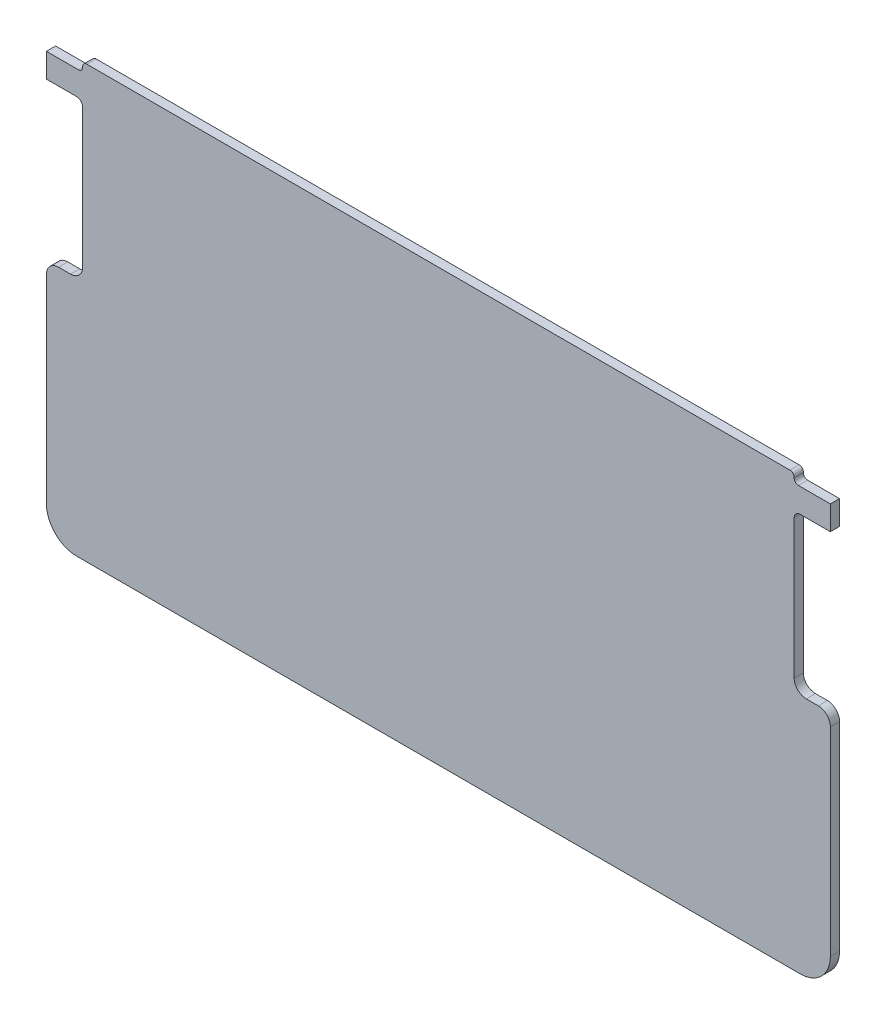
ISO-10303-21;
HEADER;
FILE_DESCRIPTION(('STEP AP214'),'2;1');
FILE_NAME('part.step','',(''),(''),'','','');
FILE_SCHEMA(('AUTOMOTIVE_DESIGN { 1 0 10303 214 1 1 1 1 }'));
ENDSEC;
DATA;
#1=APPLICATION_CONTEXT('core data for automotive mechanical design processes');
#2=APPLICATION_PROTOCOL_DEFINITION('international standard','automotive_design',2000,#1);
#3=PRODUCT_CONTEXT('',#1,'mechanical');
#4=PRODUCT('Part','Part','',(#3));
#5=PRODUCT_RELATED_PRODUCT_CATEGORY('part','',(#4));
#6=PRODUCT_DEFINITION_FORMATION('','',#4);
#7=PRODUCT_DEFINITION_CONTEXT('part definition',#1,'design');
#8=PRODUCT_DEFINITION('design','',#6,#7);
#9=PRODUCT_DEFINITION_SHAPE('','',#8);
#10=(LENGTH_UNIT() NAMED_UNIT(*) SI_UNIT(.MILLI.,.METRE.));
#11=(NAMED_UNIT(*) PLANE_ANGLE_UNIT() SI_UNIT($,.RADIAN.));
#12=(NAMED_UNIT(*) SI_UNIT($,.STERADIAN.) SOLID_ANGLE_UNIT());
#13=UNCERTAINTY_MEASURE_WITH_UNIT(LENGTH_MEASURE(1.E-05),#10,'distance_accuracy_value','');
#14=(GEOMETRIC_REPRESENTATION_CONTEXT(3) GLOBAL_UNCERTAINTY_ASSIGNED_CONTEXT((#13)) GLOBAL_UNIT_ASSIGNED_CONTEXT((#10,
#11,#12)) REPRESENTATION_CONTEXT('',''));
#15=CARTESIAN_POINT('',(0.,0.,0.));
#16=DIRECTION('',(0.,0.,1.));
#17=DIRECTION('',(1.,0.,0.));
#18=AXIS2_PLACEMENT_3D('',#15,#16,#17);
#19=CARTESIAN_POINT('',(-29.5,-34.,-0.381));
#20=DIRECTION('',(0.,-1.,0.));
#21=DIRECTION('',(0.,0.,-1.));
#22=AXIS2_PLACEMENT_3D('',#19,#20,#21);
#23=PLANE('',#22);
#24=DIRECTION('',(0.,0.,1.));
#25=VECTOR('',#24,1.);
#26=CARTESIAN_POINT('',(30.,-34.,-0.381));
#27=LINE('',#26,#25);
#28=CARTESIAN_POINT('',(30.,-34.,-0.381));
#29=VERTEX_POINT('',#28);
#30=CARTESIAN_POINT('',(30.,-34.,0.381));
#31=VERTEX_POINT('',#30);
#32=EDGE_CURVE('E38',#29,#31,#27,.T.);
#33=ORIENTED_EDGE('',*,*,#32,.T.);
#34=DIRECTION('',(1.,0.,0.));
#35=VECTOR('',#34,1.);
#36=CARTESIAN_POINT('',(29.5,-34.,0.381));
#37=LINE('',#36,#35);
#38=CARTESIAN_POINT('',(-30.,-34.,0.381));
#39=VERTEX_POINT('',#38);
#40=EDGE_CURVE('E222',#39,#31,#37,.T.);
#41=ORIENTED_EDGE('',*,*,#40,.F.);
#42=DIRECTION('',(0.,0.,1.));
#43=VECTOR('',#42,1.);
#44=CARTESIAN_POINT('',(-30.,-34.,-0.381));
#45=LINE('',#44,#43);
#46=CARTESIAN_POINT('',(-30.,-34.,-0.381));
#47=VERTEX_POINT('',#46);
#48=EDGE_CURVE('E11',#47,#39,#45,.T.);
#49=ORIENTED_EDGE('',*,*,#48,.F.);
#50=DIRECTION('',(1.,0.,0.));
#51=VECTOR('',#50,1.);
#52=CARTESIAN_POINT('',(29.5,-34.,-0.381));
#53=LINE('',#52,#51);
#54=EDGE_CURVE('E51',#47,#29,#53,.T.);
#55=ORIENTED_EDGE('',*,*,#54,.T.);
#56=EDGE_LOOP('',(#33,#41,#49,#55));
#57=FACE_BOUND('',#56,.T.);
#58=ADVANCED_FACE('F34',(#57),#23,.T.);
#59=CARTESIAN_POINT('',(-30.,-31.5,-0.381));
#60=DIRECTION('',(0.,0.,1.));
#61=DIRECTION('',(1.,0.,0.));
#62=AXIS2_PLACEMENT_3D('',#59,#60,#61);
#63=CYLINDRICAL_SURFACE('',#62,2.5);
#64=ORIENTED_EDGE('',*,*,#48,.T.);
#65=CARTESIAN_POINT('',(-30.,-31.5,0.381));
#66=DIRECTION('',(0.,0.,1.));
#67=DIRECTION('',(-1.,0.,0.));
#68=AXIS2_PLACEMENT_3D('',#65,#66,#67);
#69=CIRCLE('',#68,2.5);
#70=CARTESIAN_POINT('',(-32.5,-31.5,0.381));
#71=VERTEX_POINT('',#70);
#72=EDGE_CURVE('E237',#71,#39,#69,.T.);
#73=ORIENTED_EDGE('',*,*,#72,.F.);
#74=DIRECTION('',(0.,0.,1.));
#75=VECTOR('',#74,1.);
#76=CARTESIAN_POINT('',(-32.5,-31.5,-0.381));
#77=LINE('',#76,#75);
#78=CARTESIAN_POINT('',(-32.5,-31.5,-0.381));
#79=VERTEX_POINT('',#78);
#80=EDGE_CURVE('E43',#79,#71,#77,.T.);
#81=ORIENTED_EDGE('',*,*,#80,.F.);
#82=CARTESIAN_POINT('',(-30.,-31.5,-0.381));
#83=DIRECTION('',(0.,0.,1.));
#84=DIRECTION('',(-1.,0.,0.));
#85=AXIS2_PLACEMENT_3D('',#82,#83,#84);
#86=CIRCLE('',#85,2.5);
#87=EDGE_CURVE('E227',#79,#47,#86,.T.);
#88=ORIENTED_EDGE('',*,*,#87,.T.);
#89=EDGE_LOOP('',(#64,#73,#81,#88));
#90=FACE_BOUND('',#89,.T.);
#91=ADVANCED_FACE('F540',(#90),#63,.T.);
#92=CARTESIAN_POINT('',(-32.5,-15.,-0.381));
#93=DIRECTION('',(-1.,0.,0.));
#94=DIRECTION('',(0.,-1.,0.));
#95=AXIS2_PLACEMENT_3D('',#92,#93,#94);
#96=PLANE('',#95);
#97=ORIENTED_EDGE('',*,*,#80,.T.);
#98=DIRECTION('',(0.,-1.,0.));
#99=VECTOR('',#98,1.);
#100=CARTESIAN_POINT('',(-32.5,-15.,0.381));
#101=LINE('',#100,#99);
#102=CARTESIAN_POINT('',(-32.5,-15.,0.381));
#103=VERTEX_POINT('',#102);
#104=EDGE_CURVE('E310',#103,#71,#101,.T.);
#105=ORIENTED_EDGE('',*,*,#104,.F.);
#106=DIRECTION('',(0.,0.,1.));
#107=VECTOR('',#106,1.);
#108=CARTESIAN_POINT('',(-32.5,-15.,-0.381));
#109=LINE('',#108,#107);
#110=CARTESIAN_POINT('',(-32.5,-15.,-0.381));
#111=VERTEX_POINT('',#110);
#112=EDGE_CURVE('E393',#111,#103,#109,.T.);
#113=ORIENTED_EDGE('',*,*,#112,.F.);
#114=DIRECTION('',(0.,-1.,0.));
#115=VECTOR('',#114,1.);
#116=CARTESIAN_POINT('',(-32.5,-15.,-0.381));
#117=LINE('',#116,#115);
#118=EDGE_CURVE('E388',#111,#79,#117,.T.);
#119=ORIENTED_EDGE('',*,*,#118,.T.);
#120=EDGE_LOOP('',(#97,#105,#113,#119));
#121=FACE_BOUND('',#120,.T.);
#122=ADVANCED_FACE('F538',(#121),#96,.T.);
#123=CARTESIAN_POINT('',(-31.5,-15.,-0.381));
#124=DIRECTION('',(0.,0.,1.));
#125=DIRECTION('',(1.,0.,0.));
#126=AXIS2_PLACEMENT_3D('',#123,#124,#125);
#127=CYLINDRICAL_SURFACE('',#126,1.);
#128=ORIENTED_EDGE('',*,*,#112,.T.);
#129=CARTESIAN_POINT('',(-31.5,-15.,0.381));
#130=DIRECTION('',(0.,0.,1.));
#131=DIRECTION('',(1.,0.,0.));
#132=AXIS2_PLACEMENT_3D('',#129,#130,#131);
#133=CIRCLE('',#132,1.);
#134=CARTESIAN_POINT('',(-31.5,-14.,0.381));
#135=VERTEX_POINT('',#134);
#136=EDGE_CURVE('E307',#135,#103,#133,.T.);
#137=ORIENTED_EDGE('',*,*,#136,.F.);
#138=DIRECTION('',(0.,0.,1.));
#139=VECTOR('',#138,1.);
#140=CARTESIAN_POINT('',(-31.5,-14.,-0.381));
#141=LINE('',#140,#139);
#142=CARTESIAN_POINT('',(-31.5,-14.,-0.381));
#143=VERTEX_POINT('',#142);
#144=EDGE_CURVE('E395',#143,#135,#141,.T.);
#145=ORIENTED_EDGE('',*,*,#144,.F.);
#146=CARTESIAN_POINT('',(-31.5,-15.,-0.381));
#147=DIRECTION('',(0.,0.,1.));
#148=DIRECTION('',(1.,0.,0.));
#149=AXIS2_PLACEMENT_3D('',#146,#147,#148);
#150=CIRCLE('',#149,1.);
#151=EDGE_CURVE('E385',#143,#111,#150,.T.);
#152=ORIENTED_EDGE('',*,*,#151,.T.);
#153=EDGE_LOOP('',(#128,#137,#145,#152));
#154=FACE_BOUND('',#153,.T.);
#155=ADVANCED_FACE('F535',(#154),#127,.T.);
#156=CARTESIAN_POINT('',(-30.5,-14.,-0.381));
#157=DIRECTION('',(0.,1.,0.));
#158=DIRECTION('',(-1.,0.,0.));
#159=AXIS2_PLACEMENT_3D('',#156,#157,#158);
#160=PLANE('',#159);
#161=ORIENTED_EDGE('',*,*,#144,.T.);
#162=DIRECTION('',(-1.,0.,0.));
#163=VECTOR('',#162,1.);
#164=CARTESIAN_POINT('',(-30.5,-14.,0.381));
#165=LINE('',#164,#163);
#166=CARTESIAN_POINT('',(-30.5,-14.,0.381));
#167=VERTEX_POINT('',#166);
#168=EDGE_CURVE('E304',#167,#135,#165,.T.);
#169=ORIENTED_EDGE('',*,*,#168,.F.);
#170=DIRECTION('',(0.,0.,1.));
#171=VECTOR('',#170,1.);
#172=CARTESIAN_POINT('',(-30.5,-14.,-0.381));
#173=LINE('',#172,#171);
#174=CARTESIAN_POINT('',(-30.5,-14.,-0.381));
#175=VERTEX_POINT('',#174);
#176=EDGE_CURVE('E397',#175,#167,#173,.T.);
#177=ORIENTED_EDGE('',*,*,#176,.F.);
#178=DIRECTION('',(-1.,0.,0.));
#179=VECTOR('',#178,1.);
#180=CARTESIAN_POINT('',(-30.5,-14.,-0.381));
#181=LINE('',#180,#179);
#182=EDGE_CURVE('E382',#175,#143,#181,.T.);
#183=ORIENTED_EDGE('',*,*,#182,.T.);
#184=EDGE_LOOP('',(#161,#169,#177,#183));
#185=FACE_BOUND('',#184,.T.);
#186=ADVANCED_FACE('F533',(#185),#160,.T.);
#187=CARTESIAN_POINT('',(-30.5,-13.,-0.381));
#188=DIRECTION('',(0.,0.,1.));
#189=DIRECTION('',(1.,0.,0.));
#190=AXIS2_PLACEMENT_3D('',#187,#188,#189);
#191=CYLINDRICAL_SURFACE('',#190,0.999999999999998);
#192=ORIENTED_EDGE('',*,*,#176,.T.);
#193=CARTESIAN_POINT('',(-30.5,-13.,0.381));
#194=DIRECTION('',(0.,0.,-1.));
#195=DIRECTION('',(-1.,0.,0.));
#196=AXIS2_PLACEMENT_3D('',#193,#194,#195);
#197=CIRCLE('',#196,0.999999999999998);
#198=CARTESIAN_POINT('',(-29.5,-13.,0.381));
#199=VERTEX_POINT('',#198);
#200=EDGE_CURVE('E301',#199,#167,#197,.T.);
#201=ORIENTED_EDGE('',*,*,#200,.F.);
#202=DIRECTION('',(0.,0.,1.));
#203=VECTOR('',#202,1.);
#204=CARTESIAN_POINT('',(-29.5,-13.,-0.381));
#205=LINE('',#204,#203);
#206=CARTESIAN_POINT('',(-29.5,-13.,-0.381));
#207=VERTEX_POINT('',#206);
#208=EDGE_CURVE('E399',#207,#199,#205,.T.);
#209=ORIENTED_EDGE('',*,*,#208,.F.);
#210=CARTESIAN_POINT('',(-30.5,-13.,-0.381));
#211=DIRECTION('',(0.,0.,-1.));
#212=DIRECTION('',(-1.,0.,0.));
#213=AXIS2_PLACEMENT_3D('',#210,#211,#212);
#214=CIRCLE('',#213,0.999999999999998);
#215=EDGE_CURVE('E379',#207,#175,#214,.T.);
#216=ORIENTED_EDGE('',*,*,#215,.T.);
#217=EDGE_LOOP('',(#192,#201,#209,#216));
#218=FACE_BOUND('',#217,.T.);
#219=ADVANCED_FACE('F528',(#218),#191,.F.);
#220=CARTESIAN_POINT('',(-29.5,-1.5,-0.381));
#221=DIRECTION('',(-1.,0.,0.));
#222=DIRECTION('',(0.,-1.,0.));
#223=AXIS2_PLACEMENT_3D('',#220,#221,#222);
#224=PLANE('',#223);
#225=ORIENTED_EDGE('',*,*,#208,.T.);
#226=DIRECTION('',(0.,-1.,0.));
#227=VECTOR('',#226,1.);
#228=CARTESIAN_POINT('',(-29.5,-1.5,0.381));
#229=LINE('',#228,#227);
#230=CARTESIAN_POINT('',(-29.5,-1.5,0.381));
#231=VERTEX_POINT('',#230);
#232=EDGE_CURVE('E298',#231,#199,#229,.T.);
#233=ORIENTED_EDGE('',*,*,#232,.F.);
#234=DIRECTION('',(0.,0.,1.));
#235=VECTOR('',#234,1.);
#236=CARTESIAN_POINT('',(-29.5,-1.5,-0.381));
#237=LINE('',#236,#235);
#238=CARTESIAN_POINT('',(-29.5,-1.5,-0.381));
#239=VERTEX_POINT('',#238);
#240=EDGE_CURVE('E401',#239,#231,#237,.T.);
#241=ORIENTED_EDGE('',*,*,#240,.F.);
#242=DIRECTION('',(0.,-1.,0.));
#243=VECTOR('',#242,1.);
#244=CARTESIAN_POINT('',(-29.5,-1.5,-0.381));
#245=LINE('',#244,#243);
#246=EDGE_CURVE('E376',#239,#207,#245,.T.);
#247=ORIENTED_EDGE('',*,*,#246,.T.);
#248=EDGE_LOOP('',(#225,#233,#241,#247));
#249=FACE_BOUND('',#248,.T.);
#250=ADVANCED_FACE('F523',(#249),#224,.T.);
#251=CARTESIAN_POINT('',(-30.,-1.5,-0.381));
#252=DIRECTION('',(0.,0.,1.));
#253=DIRECTION('',(1.,0.,0.));
#254=AXIS2_PLACEMENT_3D('',#251,#252,#253);
#255=CYLINDRICAL_SURFACE('',#254,0.500000000000002);
#256=ORIENTED_EDGE('',*,*,#240,.T.);
#257=CARTESIAN_POINT('',(-30.,-1.5,0.381));
#258=DIRECTION('',(0.,0.,-1.));
#259=DIRECTION('',(1.,0.,0.));
#260=AXIS2_PLACEMENT_3D('',#257,#258,#259);
#261=CIRCLE('',#260,0.500000000000002);
#262=CARTESIAN_POINT('',(-30.,-1.,0.381));
#263=VERTEX_POINT('',#262);
#264=EDGE_CURVE('E295',#263,#231,#261,.T.);
#265=ORIENTED_EDGE('',*,*,#264,.F.);
#266=DIRECTION('',(0.,0.,1.));
#267=VECTOR('',#266,1.);
#268=CARTESIAN_POINT('',(-30.,-1.,-0.381));
#269=LINE('',#268,#267);
#270=CARTESIAN_POINT('',(-30.,-1.,-0.381));
#271=VERTEX_POINT('',#270);
#272=EDGE_CURVE('E403',#271,#263,#269,.T.);
#273=ORIENTED_EDGE('',*,*,#272,.F.);
#274=CARTESIAN_POINT('',(-30.,-1.5,-0.381));
#275=DIRECTION('',(0.,0.,-1.));
#276=DIRECTION('',(1.,0.,0.));
#277=AXIS2_PLACEMENT_3D('',#274,#275,#276);
#278=CIRCLE('',#277,0.500000000000002);
#279=EDGE_CURVE('E373',#271,#239,#278,.T.);
#280=ORIENTED_EDGE('',*,*,#279,.T.);
#281=EDGE_LOOP('',(#256,#265,#273,#280));
#282=FACE_BOUND('',#281,.T.);
#283=ADVANCED_FACE('F521',(#282),#255,.F.);
#284=CARTESIAN_POINT('',(-30.,-1.,-0.381));
#285=DIRECTION('',(0.,-1.,0.));
#286=DIRECTION('',(1.,0.,0.));
#287=AXIS2_PLACEMENT_3D('',#284,#285,#286);
#288=PLANE('',#287);
#289=ORIENTED_EDGE('',*,*,#272,.T.);
#290=DIRECTION('',(1.,0.,0.));
#291=VECTOR('',#290,1.);
#292=CARTESIAN_POINT('',(-30.,-1.,0.381));
#293=LINE('',#292,#291);
#294=CARTESIAN_POINT('',(-32.5,-0.999999999999996,0.381));
#295=VERTEX_POINT('',#294);
#296=EDGE_CURVE('E292',#295,#263,#293,.T.);
#297=ORIENTED_EDGE('',*,*,#296,.F.);
#298=DIRECTION('',(0.,0.,1.));
#299=VECTOR('',#298,1.);
#300=CARTESIAN_POINT('',(-32.5,-0.999999999999996,-0.381));
#301=LINE('',#300,#299);
#302=CARTESIAN_POINT('',(-32.5,-0.999999999999996,-0.381));
#303=VERTEX_POINT('',#302);
#304=EDGE_CURVE('E405',#303,#295,#301,.T.);
#305=ORIENTED_EDGE('',*,*,#304,.F.);
#306=DIRECTION('',(1.,0.,0.));
#307=VECTOR('',#306,1.);
#308=CARTESIAN_POINT('',(-30.,-1.,-0.381));
#309=LINE('',#308,#307);
#310=EDGE_CURVE('E370',#303,#271,#309,.T.);
#311=ORIENTED_EDGE('',*,*,#310,.T.);
#312=EDGE_LOOP('',(#289,#297,#305,#311));
#313=FACE_BOUND('',#312,.T.);
#314=ADVANCED_FACE('F516',(#313),#288,.T.);
#315=CARTESIAN_POINT('',(-32.5,-0.999999999999996,-0.381));
#316=DIRECTION('',(-1.,0.,0.));
#317=DIRECTION('',(0.,0.,1.));
#318=AXIS2_PLACEMENT_3D('',#315,#316,#317);
#319=PLANE('',#318);
#320=ORIENTED_EDGE('',*,*,#304,.T.);
#321=DIRECTION('',(0.,-1.,0.));
#322=VECTOR('',#321,1.);
#323=CARTESIAN_POINT('',(-32.5,-0.999999999999996,0.381));
#324=LINE('',#323,#322);
#325=CARTESIAN_POINT('',(-32.5,1.,0.381));
#326=VERTEX_POINT('',#325);
#327=EDGE_CURVE('E289',#326,#295,#324,.T.);
#328=ORIENTED_EDGE('',*,*,#327,.F.);
#329=DIRECTION('',(0.,0.,1.));
#330=VECTOR('',#329,1.);
#331=CARTESIAN_POINT('',(-32.5,1.,-0.381));
#332=LINE('',#331,#330);
#333=CARTESIAN_POINT('',(-32.5,1.,-0.381));
#334=VERTEX_POINT('',#333);
#335=EDGE_CURVE('E407',#334,#326,#332,.T.);
#336=ORIENTED_EDGE('',*,*,#335,.F.);
#337=DIRECTION('',(0.,-1.,0.));
#338=VECTOR('',#337,1.);
#339=CARTESIAN_POINT('',(-32.5,-0.999999999999996,-0.381));
#340=LINE('',#339,#338);
#341=EDGE_CURVE('E367',#334,#303,#340,.T.);
#342=ORIENTED_EDGE('',*,*,#341,.T.);
#343=EDGE_LOOP('',(#320,#328,#336,#342));
#344=FACE_BOUND('',#343,.T.);
#345=ADVANCED_FACE('F511',(#344),#319,.T.);
#346=CARTESIAN_POINT('',(-32.5,1.,-0.381));
#347=DIRECTION('',(0.,1.,0.));
#348=DIRECTION('',(0.,0.,1.));
#349=AXIS2_PLACEMENT_3D('',#346,#347,#348);
#350=PLANE('',#349);
#351=ORIENTED_EDGE('',*,*,#335,.T.);
#352=DIRECTION('',(-1.,0.,0.));
#353=VECTOR('',#352,1.);
#354=CARTESIAN_POINT('',(-32.5,1.,0.381));
#355=LINE('',#354,#353);
#356=CARTESIAN_POINT('',(-29.85,1.,0.381));
#357=VERTEX_POINT('',#356);
#358=EDGE_CURVE('E286',#357,#326,#355,.T.);
#359=ORIENTED_EDGE('',*,*,#358,.F.);
#360=DIRECTION('',(0.,0.,1.));
#361=VECTOR('',#360,1.);
#362=CARTESIAN_POINT('',(-29.85,1.,-0.381));
#363=LINE('',#362,#361);
#364=CARTESIAN_POINT('',(-29.85,1.,-0.381));
#365=VERTEX_POINT('',#364);
#366=EDGE_CURVE('E409',#365,#357,#363,.T.);
#367=ORIENTED_EDGE('',*,*,#366,.F.);
#368=DIRECTION('',(-1.,0.,0.));
#369=VECTOR('',#368,1.);
#370=CARTESIAN_POINT('',(-32.5,1.,-0.381));
#371=LINE('',#370,#369);
#372=EDGE_CURVE('E364',#365,#334,#371,.T.);
#373=ORIENTED_EDGE('',*,*,#372,.T.);
#374=EDGE_LOOP('',(#351,#359,#367,#373));
#375=FACE_BOUND('',#374,.T.);
#376=ADVANCED_FACE('F509',(#375),#350,.T.);
#377=CARTESIAN_POINT('',(-29.85,1.35,-0.381));
#378=DIRECTION('',(0.,0.,1.));
#379=DIRECTION('',(1.,0.,0.));
#380=AXIS2_PLACEMENT_3D('',#377,#378,#379);
#381=CYLINDRICAL_SURFACE('',#380,0.35);
#382=ORIENTED_EDGE('',*,*,#366,.T.);
#383=CARTESIAN_POINT('',(-29.85,1.35,0.381));
#384=DIRECTION('',(0.,0.,-1.));
#385=DIRECTION('',(1.,0.,0.));
#386=AXIS2_PLACEMENT_3D('',#383,#384,#385);
#387=CIRCLE('',#386,0.35);
#388=CARTESIAN_POINT('',(-29.5,1.35,0.381));
#389=VERTEX_POINT('',#388);
#390=EDGE_CURVE('E283',#389,#357,#387,.T.);
#391=ORIENTED_EDGE('',*,*,#390,.F.);
#392=DIRECTION('',(0.,0.,1.));
#393=VECTOR('',#392,1.);
#394=CARTESIAN_POINT('',(-29.5,1.35,-0.381));
#395=LINE('',#394,#393);
#396=CARTESIAN_POINT('',(-29.5,1.35,-0.381));
#397=VERTEX_POINT('',#396);
#398=EDGE_CURVE('E411',#397,#389,#395,.T.);
#399=ORIENTED_EDGE('',*,*,#398,.F.);
#400=CARTESIAN_POINT('',(-29.85,1.35,-0.381));
#401=DIRECTION('',(0.,0.,-1.));
#402=DIRECTION('',(1.,0.,0.));
#403=AXIS2_PLACEMENT_3D('',#400,#401,#402);
#404=CIRCLE('',#403,0.35);
#405=EDGE_CURVE('E361',#397,#365,#404,.T.);
#406=ORIENTED_EDGE('',*,*,#405,.T.);
#407=EDGE_LOOP('',(#382,#391,#399,#406));
#408=FACE_BOUND('',#407,.T.);
#409=ADVANCED_FACE('F504',(#408),#381,.F.);
#410=CARTESIAN_POINT('',(-29.5,1.35,-0.381));
#411=DIRECTION('',(-1.,0.,0.));
#412=DIRECTION('',(0.,0.,1.));
#413=AXIS2_PLACEMENT_3D('',#410,#411,#412);
#414=PLANE('',#413);
#415=ORIENTED_EDGE('',*,*,#398,.T.);
#416=DIRECTION('',(0.,-1.,0.));
#417=VECTOR('',#416,1.);
#418=CARTESIAN_POINT('',(-29.5,1.35,0.381));
#419=LINE('',#418,#417);
#420=CARTESIAN_POINT('',(-29.5,1.4,0.381));
#421=VERTEX_POINT('',#420);
#422=EDGE_CURVE('E280',#421,#389,#419,.T.);
#423=ORIENTED_EDGE('',*,*,#422,.F.);
#424=DIRECTION('',(0.,0.,1.));
#425=VECTOR('',#424,1.);
#426=CARTESIAN_POINT('',(-29.5,1.4,-0.381));
#427=LINE('',#426,#425);
#428=CARTESIAN_POINT('',(-29.5,1.4,-0.381));
#429=VERTEX_POINT('',#428);
#430=EDGE_CURVE('E413',#429,#421,#427,.T.);
#431=ORIENTED_EDGE('',*,*,#430,.F.);
#432=DIRECTION('',(0.,-1.,0.));
#433=VECTOR('',#432,1.);
#434=CARTESIAN_POINT('',(-29.5,1.35,-0.381));
#435=LINE('',#434,#433);
#436=EDGE_CURVE('E358',#429,#397,#435,.T.);
#437=ORIENTED_EDGE('',*,*,#436,.T.);
#438=EDGE_LOOP('',(#415,#423,#431,#437));
#439=FACE_BOUND('',#438,.T.);
#440=ADVANCED_FACE('F499',(#439),#414,.T.);
#441=CARTESIAN_POINT('',(-29.15,1.4,-0.381));
#442=DIRECTION('',(0.,0.,1.));
#443=DIRECTION('',(1.,0.,0.));
#444=AXIS2_PLACEMENT_3D('',#441,#442,#443);
#445=CYLINDRICAL_SURFACE('',#444,0.35);
#446=ORIENTED_EDGE('',*,*,#430,.T.);
#447=CARTESIAN_POINT('',(-29.15,1.4,0.381));
#448=DIRECTION('',(0.,0.,1.));
#449=DIRECTION('',(-1.,0.,0.));
#450=AXIS2_PLACEMENT_3D('',#447,#448,#449);
#451=CIRCLE('',#450,0.35);
#452=CARTESIAN_POINT('',(-29.15,1.75,0.381));
#453=VERTEX_POINT('',#452);
#454=EDGE_CURVE('E277',#453,#421,#451,.T.);
#455=ORIENTED_EDGE('',*,*,#454,.F.);
#456=DIRECTION('',(0.,0.,1.));
#457=VECTOR('',#456,1.);
#458=CARTESIAN_POINT('',(-29.15,1.75,-0.381));
#459=LINE('',#458,#457);
#460=CARTESIAN_POINT('',(-29.15,1.75,-0.381));
#461=VERTEX_POINT('',#460);
#462=EDGE_CURVE('E415',#461,#453,#459,.T.);
#463=ORIENTED_EDGE('',*,*,#462,.F.);
#464=CARTESIAN_POINT('',(-29.15,1.4,-0.381));
#465=DIRECTION('',(0.,0.,1.));
#466=DIRECTION('',(-1.,0.,0.));
#467=AXIS2_PLACEMENT_3D('',#464,#465,#466);
#468=CIRCLE('',#467,0.35);
#469=EDGE_CURVE('E355',#461,#429,#468,.T.);
#470=ORIENTED_EDGE('',*,*,#469,.T.);
#471=EDGE_LOOP('',(#446,#455,#463,#470));
#472=FACE_BOUND('',#471,.T.);
#473=ADVANCED_FACE('F497',(#472),#445,.T.);
#474=CARTESIAN_POINT('',(-29.15,1.75,-0.381));
#475=DIRECTION('',(0.,1.,0.));
#476=DIRECTION('',(0.,0.,1.));
#477=AXIS2_PLACEMENT_3D('',#474,#475,#476);
#478=PLANE('',#477);
#479=ORIENTED_EDGE('',*,*,#462,.T.);
#480=DIRECTION('',(-1.,0.,0.));
#481=VECTOR('',#480,1.);
#482=CARTESIAN_POINT('',(-29.15,1.75,0.381));
#483=LINE('',#482,#481);
#484=CARTESIAN_POINT('',(29.15,1.75,0.381));
#485=VERTEX_POINT('',#484);
#486=EDGE_CURVE('E274',#485,#453,#483,.T.);
#487=ORIENTED_EDGE('',*,*,#486,.F.);
#488=DIRECTION('',(0.,0.,1.));
#489=VECTOR('',#488,1.);
#490=CARTESIAN_POINT('',(29.15,1.75,-0.381));
#491=LINE('',#490,#489);
#492=CARTESIAN_POINT('',(29.15,1.75,-0.381));
#493=VERTEX_POINT('',#492);
#494=EDGE_CURVE('E417',#493,#485,#491,.T.);
#495=ORIENTED_EDGE('',*,*,#494,.F.);
#496=DIRECTION('',(-1.,0.,0.));
#497=VECTOR('',#496,1.);
#498=CARTESIAN_POINT('',(-29.15,1.75,-0.381));
#499=LINE('',#498,#497);
#500=EDGE_CURVE('E352',#493,#461,#499,.T.);
#501=ORIENTED_EDGE('',*,*,#500,.T.);
#502=EDGE_LOOP('',(#479,#487,#495,#501));
#503=FACE_BOUND('',#502,.T.);
#504=ADVANCED_FACE('F492',(#503),#478,.T.);
#505=CARTESIAN_POINT('',(29.15,1.4,-0.381));
#506=DIRECTION('',(0.,0.,1.));
#507=DIRECTION('',(1.,0.,0.));
#508=AXIS2_PLACEMENT_3D('',#505,#506,#507);
#509=CYLINDRICAL_SURFACE('',#508,0.350000000000003);
#510=ORIENTED_EDGE('',*,*,#494,.T.);
#511=CARTESIAN_POINT('',(29.15,1.4,0.381));
#512=DIRECTION('',(0.,0.,1.));
#513=DIRECTION('',(-1.,0.,0.));
#514=AXIS2_PLACEMENT_3D('',#511,#512,#513);
#515=CIRCLE('',#514,0.350000000000003);
#516=CARTESIAN_POINT('',(29.5,1.4,0.381));
#517=VERTEX_POINT('',#516);
#518=EDGE_CURVE('E271',#517,#485,#515,.T.);
#519=ORIENTED_EDGE('',*,*,#518,.F.);
#520=DIRECTION('',(0.,0.,1.));
#521=VECTOR('',#520,1.);
#522=CARTESIAN_POINT('',(29.5,1.4,-0.381));
#523=LINE('',#522,#521);
#524=CARTESIAN_POINT('',(29.5,1.4,-0.381));
#525=VERTEX_POINT('',#524);
#526=EDGE_CURVE('E419',#525,#517,#523,.T.);
#527=ORIENTED_EDGE('',*,*,#526,.F.);
#528=CARTESIAN_POINT('',(29.15,1.4,-0.381));
#529=DIRECTION('',(0.,0.,1.));
#530=DIRECTION('',(-1.,0.,0.));
#531=AXIS2_PLACEMENT_3D('',#528,#529,#530);
#532=CIRCLE('',#531,0.350000000000003);
#533=EDGE_CURVE('E349',#525,#493,#532,.T.);
#534=ORIENTED_EDGE('',*,*,#533,.T.);
#535=EDGE_LOOP('',(#510,#519,#527,#534));
#536=FACE_BOUND('',#535,.T.);
#537=ADVANCED_FACE('F487',(#536),#509,.T.);
#538=CARTESIAN_POINT('',(29.5,1.4,-0.381));
#539=DIRECTION('',(1.,0.,0.));
#540=DIRECTION('',(0.,0.,-1.));
#541=AXIS2_PLACEMENT_3D('',#538,#539,#540);
#542=PLANE('',#541);
#543=ORIENTED_EDGE('',*,*,#526,.T.);
#544=DIRECTION('',(0.,1.,0.));
#545=VECTOR('',#544,1.);
#546=CARTESIAN_POINT('',(29.5,1.4,0.381));
#547=LINE('',#546,#545);
#548=CARTESIAN_POINT('',(29.5,1.35,0.381));
#549=VERTEX_POINT('',#548);
#550=EDGE_CURVE('E268',#549,#517,#547,.T.);
#551=ORIENTED_EDGE('',*,*,#550,.F.);
#552=DIRECTION('',(0.,0.,1.));
#553=VECTOR('',#552,1.);
#554=CARTESIAN_POINT('',(29.5,1.35,-0.381));
#555=LINE('',#554,#553);
#556=CARTESIAN_POINT('',(29.5,1.35,-0.381));
#557=VERTEX_POINT('',#556);
#558=EDGE_CURVE('E421',#557,#549,#555,.T.);
#559=ORIENTED_EDGE('',*,*,#558,.F.);
#560=DIRECTION('',(0.,1.,0.));
#561=VECTOR('',#560,1.);
#562=CARTESIAN_POINT('',(29.5,1.4,-0.381));
#563=LINE('',#562,#561);
#564=EDGE_CURVE('E346',#557,#525,#563,.T.);
#565=ORIENTED_EDGE('',*,*,#564,.T.);
#566=EDGE_LOOP('',(#543,#551,#559,#565));
#567=FACE_BOUND('',#566,.T.);
#568=ADVANCED_FACE('F485',(#567),#542,.T.);
#569=CARTESIAN_POINT('',(29.85,1.35,-0.381));
#570=DIRECTION('',(0.,0.,1.));
#571=DIRECTION('',(1.,0.,0.));
#572=AXIS2_PLACEMENT_3D('',#569,#570,#571);
#573=CYLINDRICAL_SURFACE('',#572,0.349999999999998);
#574=ORIENTED_EDGE('',*,*,#558,.T.);
#575=CARTESIAN_POINT('',(29.85,1.35,0.381));
#576=DIRECTION('',(0.,0.,-1.));
#577=DIRECTION('',(1.,0.,0.));
#578=AXIS2_PLACEMENT_3D('',#575,#576,#577);
#579=CIRCLE('',#578,0.349999999999998);
#580=CARTESIAN_POINT('',(29.85,1.00000000000001,0.381));
#581=VERTEX_POINT('',#580);
#582=EDGE_CURVE('E265',#581,#549,#579,.T.);
#583=ORIENTED_EDGE('',*,*,#582,.F.);
#584=DIRECTION('',(0.,0.,1.));
#585=VECTOR('',#584,1.);
#586=CARTESIAN_POINT('',(29.85,1.00000000000001,-0.381));
#587=LINE('',#586,#585);
#588=CARTESIAN_POINT('',(29.85,1.00000000000001,-0.381));
#589=VERTEX_POINT('',#588);
#590=EDGE_CURVE('E423',#589,#581,#587,.T.);
#591=ORIENTED_EDGE('',*,*,#590,.F.);
#592=CARTESIAN_POINT('',(29.85,1.35,-0.381));
#593=DIRECTION('',(0.,0.,-1.));
#594=DIRECTION('',(1.,0.,0.));
#595=AXIS2_PLACEMENT_3D('',#592,#593,#594);
#596=CIRCLE('',#595,0.349999999999998);
#597=EDGE_CURVE('E343',#589,#557,#596,.T.);
#598=ORIENTED_EDGE('',*,*,#597,.T.);
#599=EDGE_LOOP('',(#574,#583,#591,#598));
#600=FACE_BOUND('',#599,.T.);
#601=ADVANCED_FACE('F480',(#600),#573,.F.);
#602=CARTESIAN_POINT('',(29.85,1.,-0.381));
#603=DIRECTION('',(0.,1.,0.));
#604=DIRECTION('',(-1.,0.,0.));
#605=AXIS2_PLACEMENT_3D('',#602,#603,#604);
#606=PLANE('',#605);
#607=ORIENTED_EDGE('',*,*,#590,.T.);
#608=DIRECTION('',(-1.,0.,0.));
#609=VECTOR('',#608,1.);
#610=CARTESIAN_POINT('',(29.85,1.,0.381));
#611=LINE('',#610,#609);
#612=CARTESIAN_POINT('',(32.5,1.,0.381));
#613=VERTEX_POINT('',#612);
#614=EDGE_CURVE('E262',#613,#581,#611,.T.);
#615=ORIENTED_EDGE('',*,*,#614,.F.);
#616=DIRECTION('',(0.,0.,1.));
#617=VECTOR('',#616,1.);
#618=CARTESIAN_POINT('',(32.5,1.,-0.381));
#619=LINE('',#618,#617);
#620=CARTESIAN_POINT('',(32.5,1.,-0.381));
#621=VERTEX_POINT('',#620);
#622=EDGE_CURVE('E425',#621,#613,#619,.T.);
#623=ORIENTED_EDGE('',*,*,#622,.F.);
#624=DIRECTION('',(-1.,0.,0.));
#625=VECTOR('',#624,1.);
#626=CARTESIAN_POINT('',(29.85,1.,-0.381));
#627=LINE('',#626,#625);
#628=EDGE_CURVE('E340',#621,#589,#627,.T.);
#629=ORIENTED_EDGE('',*,*,#628,.T.);
#630=EDGE_LOOP('',(#607,#615,#623,#629));
#631=FACE_BOUND('',#630,.T.);
#632=ADVANCED_FACE('F475',(#631),#606,.T.);
#633=CARTESIAN_POINT('',(32.5,-1.,-0.381));
#634=DIRECTION('',(1.,0.,0.));
#635=DIRECTION('',(0.,0.,-1.));
#636=AXIS2_PLACEMENT_3D('',#633,#634,#635);
#637=PLANE('',#636);
#638=ORIENTED_EDGE('',*,*,#622,.T.);
#639=DIRECTION('',(0.,1.,0.));
#640=VECTOR('',#639,1.);
#641=CARTESIAN_POINT('',(32.5,-1.,0.381));
#642=LINE('',#641,#640);
#643=CARTESIAN_POINT('',(32.5,-1.,0.381));
#644=VERTEX_POINT('',#643);
#645=EDGE_CURVE('E259',#644,#613,#642,.T.);
#646=ORIENTED_EDGE('',*,*,#645,.F.);
#647=DIRECTION('',(0.,0.,1.));
#648=VECTOR('',#647,1.);
#649=CARTESIAN_POINT('',(32.5,-1.,-0.381));
#650=LINE('',#649,#648);
#651=CARTESIAN_POINT('',(32.5,-1.,-0.381));
#652=VERTEX_POINT('',#651);
#653=EDGE_CURVE('E427',#652,#644,#650,.T.);
#654=ORIENTED_EDGE('',*,*,#653,.F.);
#655=DIRECTION('',(0.,1.,0.));
#656=VECTOR('',#655,1.);
#657=CARTESIAN_POINT('',(32.5,-1.,-0.381));
#658=LINE('',#657,#656);
#659=EDGE_CURVE('E337',#652,#621,#658,.T.);
#660=ORIENTED_EDGE('',*,*,#659,.T.);
#661=EDGE_LOOP('',(#638,#646,#654,#660));
#662=FACE_BOUND('',#661,.T.);
#663=ADVANCED_FACE('F473',(#662),#637,.T.);
#664=CARTESIAN_POINT('',(30.,-0.999999999999997,-0.381));
#665=DIRECTION('',(0.,-1.,0.));
#666=DIRECTION('',(1.,0.,0.));
#667=AXIS2_PLACEMENT_3D('',#664,#665,#666);
#668=PLANE('',#667);
#669=ORIENTED_EDGE('',*,*,#653,.T.);
#670=DIRECTION('',(1.,0.,0.));
#671=VECTOR('',#670,1.);
#672=CARTESIAN_POINT('',(30.,-0.999999999999997,0.381));
#673=LINE('',#672,#671);
#674=CARTESIAN_POINT('',(30.,-0.999999999999997,0.381));
#675=VERTEX_POINT('',#674);
#676=EDGE_CURVE('E256',#675,#644,#673,.T.);
#677=ORIENTED_EDGE('',*,*,#676,.F.);
#678=DIRECTION('',(0.,0.,1.));
#679=VECTOR('',#678,1.);
#680=CARTESIAN_POINT('',(30.,-0.999999999999997,-0.381));
#681=LINE('',#680,#679);
#682=CARTESIAN_POINT('',(30.,-0.999999999999997,-0.381));
#683=VERTEX_POINT('',#682);
#684=EDGE_CURVE('E429',#683,#675,#681,.T.);
#685=ORIENTED_EDGE('',*,*,#684,.F.);
#686=DIRECTION('',(1.,0.,0.));
#687=VECTOR('',#686,1.);
#688=CARTESIAN_POINT('',(30.,-0.999999999999997,-0.381));
#689=LINE('',#688,#687);
#690=EDGE_CURVE('E334',#683,#652,#689,.T.);
#691=ORIENTED_EDGE('',*,*,#690,.T.);
#692=EDGE_LOOP('',(#669,#677,#685,#691));
#693=FACE_BOUND('',#692,.T.);
#694=ADVANCED_FACE('F468',(#693),#668,.T.);
#695=CARTESIAN_POINT('',(30.,-1.49999999999999,-0.381));
#696=DIRECTION('',(0.,0.,1.));
#697=DIRECTION('',(1.,0.,0.));
#698=AXIS2_PLACEMENT_3D('',#695,#696,#697);
#699=CYLINDRICAL_SURFACE('',#698,0.500000000000001);
#700=ORIENTED_EDGE('',*,*,#684,.T.);
#701=CARTESIAN_POINT('',(30.,-1.49999999999999,0.381));
#702=DIRECTION('',(0.,0.,-1.));
#703=DIRECTION('',(1.,0.,0.));
#704=AXIS2_PLACEMENT_3D('',#701,#702,#703);
#705=CIRCLE('',#704,0.500000000000001);
#706=CARTESIAN_POINT('',(29.5,-1.49999999999999,0.381));
#707=VERTEX_POINT('',#706);
#708=EDGE_CURVE('E253',#707,#675,#705,.T.);
#709=ORIENTED_EDGE('',*,*,#708,.F.);
#710=DIRECTION('',(0.,0.,1.));
#711=VECTOR('',#710,1.);
#712=CARTESIAN_POINT('',(29.5,-1.49999999999999,-0.381));
#713=LINE('',#712,#711);
#714=CARTESIAN_POINT('',(29.5,-1.49999999999999,-0.381));
#715=VERTEX_POINT('',#714);
#716=EDGE_CURVE('E431',#715,#707,#713,.T.);
#717=ORIENTED_EDGE('',*,*,#716,.F.);
#718=CARTESIAN_POINT('',(30.,-1.49999999999999,-0.381));
#719=DIRECTION('',(0.,0.,-1.));
#720=DIRECTION('',(1.,0.,0.));
#721=AXIS2_PLACEMENT_3D('',#718,#719,#720);
#722=CIRCLE('',#721,0.500000000000001);
#723=EDGE_CURVE('E331',#715,#683,#722,.T.);
#724=ORIENTED_EDGE('',*,*,#723,.T.);
#725=EDGE_LOOP('',(#700,#709,#717,#724));
#726=FACE_BOUND('',#725,.T.);
#727=ADVANCED_FACE('F463',(#726),#699,.F.);
#728=CARTESIAN_POINT('',(29.5,-13.,-0.381));
#729=DIRECTION('',(1.,0.,0.));
#730=DIRECTION('',(0.,1.,0.));
#731=AXIS2_PLACEMENT_3D('',#728,#729,#730);
#732=PLANE('',#731);
#733=ORIENTED_EDGE('',*,*,#716,.T.);
#734=DIRECTION('',(0.,1.,0.));
#735=VECTOR('',#734,1.);
#736=CARTESIAN_POINT('',(29.5,-13.,0.381));
#737=LINE('',#736,#735);
#738=CARTESIAN_POINT('',(29.5,-13.,0.381));
#739=VERTEX_POINT('',#738);
#740=EDGE_CURVE('E250',#739,#707,#737,.T.);
#741=ORIENTED_EDGE('',*,*,#740,.F.);
#742=DIRECTION('',(0.,0.,1.));
#743=VECTOR('',#742,1.);
#744=CARTESIAN_POINT('',(29.5,-13.,-0.381));
#745=LINE('',#744,#743);
#746=CARTESIAN_POINT('',(29.5,-13.,-0.381));
#747=VERTEX_POINT('',#746);
#748=EDGE_CURVE('E433',#747,#739,#745,.T.);
#749=ORIENTED_EDGE('',*,*,#748,.F.);
#750=DIRECTION('',(0.,1.,0.));
#751=VECTOR('',#750,1.);
#752=CARTESIAN_POINT('',(29.5,-13.,-0.381));
#753=LINE('',#752,#751);
#754=EDGE_CURVE('E328',#747,#715,#753,.T.);
#755=ORIENTED_EDGE('',*,*,#754,.T.);
#756=EDGE_LOOP('',(#733,#741,#749,#755));
#757=FACE_BOUND('',#756,.T.);
#758=ADVANCED_FACE('F461',(#757),#732,.T.);
#759=CARTESIAN_POINT('',(30.5,-13.,-0.381));
#760=DIRECTION('',(0.,0.,1.));
#761=DIRECTION('',(1.,0.,0.));
#762=AXIS2_PLACEMENT_3D('',#759,#760,#761);
#763=CYLINDRICAL_SURFACE('',#762,1.);
#764=ORIENTED_EDGE('',*,*,#748,.T.);
#765=CARTESIAN_POINT('',(30.5,-13.,0.381));
#766=DIRECTION('',(0.,0.,-1.));
#767=DIRECTION('',(-1.,0.,0.));
#768=AXIS2_PLACEMENT_3D('',#765,#766,#767);
#769=CIRCLE('',#768,1.);
#770=CARTESIAN_POINT('',(30.5,-14.,0.381));
#771=VERTEX_POINT('',#770);
#772=EDGE_CURVE('E247',#771,#739,#769,.T.);
#773=ORIENTED_EDGE('',*,*,#772,.F.);
#774=DIRECTION('',(0.,0.,1.));
#775=VECTOR('',#774,1.);
#776=CARTESIAN_POINT('',(30.5,-14.,-0.381));
#777=LINE('',#776,#775);
#778=CARTESIAN_POINT('',(30.5,-14.,-0.381));
#779=VERTEX_POINT('',#778);
#780=EDGE_CURVE('E435',#779,#771,#777,.T.);
#781=ORIENTED_EDGE('',*,*,#780,.F.);
#782=CARTESIAN_POINT('',(30.5,-13.,-0.381));
#783=DIRECTION('',(0.,0.,-1.));
#784=DIRECTION('',(-1.,0.,0.));
#785=AXIS2_PLACEMENT_3D('',#782,#783,#784);
#786=CIRCLE('',#785,1.);
#787=EDGE_CURVE('E325',#779,#747,#786,.T.);
#788=ORIENTED_EDGE('',*,*,#787,.T.);
#789=EDGE_LOOP('',(#764,#773,#781,#788));
#790=FACE_BOUND('',#789,.T.);
#791=ADVANCED_FACE('F456',(#790),#763,.F.);
#792=CARTESIAN_POINT('',(31.5,-14.,-0.381));
#793=DIRECTION('',(0.,1.,0.));
#794=DIRECTION('',(-1.,0.,0.));
#795=AXIS2_PLACEMENT_3D('',#792,#793,#794);
#796=PLANE('',#795);
#797=ORIENTED_EDGE('',*,*,#780,.T.);
#798=DIRECTION('',(-1.,0.,0.));
#799=VECTOR('',#798,1.);
#800=CARTESIAN_POINT('',(31.5,-14.,0.381));
#801=LINE('',#800,#799);
#802=CARTESIAN_POINT('',(31.5,-14.,0.381));
#803=VERTEX_POINT('',#802);
#804=EDGE_CURVE('E244',#803,#771,#801,.T.);
#805=ORIENTED_EDGE('',*,*,#804,.F.);
#806=DIRECTION('',(0.,0.,1.));
#807=VECTOR('',#806,1.);
#808=CARTESIAN_POINT('',(31.5,-14.,-0.381));
#809=LINE('',#808,#807);
#810=CARTESIAN_POINT('',(31.5,-14.,-0.381));
#811=VERTEX_POINT('',#810);
#812=EDGE_CURVE('E437',#811,#803,#809,.T.);
#813=ORIENTED_EDGE('',*,*,#812,.F.);
#814=DIRECTION('',(-1.,0.,0.));
#815=VECTOR('',#814,1.);
#816=CARTESIAN_POINT('',(31.5,-14.,-0.381));
#817=LINE('',#816,#815);
#818=EDGE_CURVE('E322',#811,#779,#817,.T.);
#819=ORIENTED_EDGE('',*,*,#818,.T.);
#820=EDGE_LOOP('',(#797,#805,#813,#819));
#821=FACE_BOUND('',#820,.T.);
#822=ADVANCED_FACE('F450',(#821),#796,.T.);
#823=CARTESIAN_POINT('',(31.5,-15.,-0.381));
#824=DIRECTION('',(0.,0.,1.));
#825=DIRECTION('',(1.,0.,0.));
#826=AXIS2_PLACEMENT_3D('',#823,#824,#825);
#827=CYLINDRICAL_SURFACE('',#826,1.);
#828=ORIENTED_EDGE('',*,*,#812,.T.);
#829=CARTESIAN_POINT('',(31.5,-15.,0.381));
#830=DIRECTION('',(0.,0.,1.));
#831=DIRECTION('',(1.,0.,0.));
#832=AXIS2_PLACEMENT_3D('',#829,#830,#831);
#833=CIRCLE('',#832,1.);
#834=CARTESIAN_POINT('',(32.5,-15.,0.381));
#835=VERTEX_POINT('',#834);
#836=EDGE_CURVE('E241',#835,#803,#833,.T.);
#837=ORIENTED_EDGE('',*,*,#836,.F.);
#838=DIRECTION('',(0.,0.,1.));
#839=VECTOR('',#838,1.);
#840=CARTESIAN_POINT('',(32.5,-15.,-0.381));
#841=LINE('',#840,#839);
#842=CARTESIAN_POINT('',(32.5,-15.,-0.381));
#843=VERTEX_POINT('',#842);
#844=EDGE_CURVE('E439',#843,#835,#841,.T.);
#845=ORIENTED_EDGE('',*,*,#844,.F.);
#846=CARTESIAN_POINT('',(31.5,-15.,-0.381));
#847=DIRECTION('',(0.,0.,1.));
#848=DIRECTION('',(1.,0.,0.));
#849=AXIS2_PLACEMENT_3D('',#846,#847,#848);
#850=CIRCLE('',#849,1.);
#851=EDGE_CURVE('E319',#843,#811,#850,.T.);
#852=ORIENTED_EDGE('',*,*,#851,.T.);
#853=EDGE_LOOP('',(#828,#837,#845,#852));
#854=FACE_BOUND('',#853,.T.);
#855=ADVANCED_FACE('F447',(#854),#827,.T.);
#856=CARTESIAN_POINT('',(32.5,-31.5,-0.381));
#857=DIRECTION('',(1.,0.,0.));
#858=DIRECTION('',(0.,0.,-1.));
#859=AXIS2_PLACEMENT_3D('',#856,#857,#858);
#860=PLANE('',#859);
#861=ORIENTED_EDGE('',*,*,#844,.T.);
#862=DIRECTION('',(0.,1.,0.));
#863=VECTOR('',#862,1.);
#864=CARTESIAN_POINT('',(32.5,-31.5,0.381));
#865=LINE('',#864,#863);
#866=CARTESIAN_POINT('',(32.5,-31.5,0.381));
#867=VERTEX_POINT('',#866);
#868=EDGE_CURVE('E233',#867,#835,#865,.T.);
#869=ORIENTED_EDGE('',*,*,#868,.F.);
#870=DIRECTION('',(0.,0.,1.));
#871=VECTOR('',#870,1.);
#872=CARTESIAN_POINT('',(32.5,-31.5,-0.381));
#873=LINE('',#872,#871);
#874=CARTESIAN_POINT('',(32.5,-31.5,-0.381));
#875=VERTEX_POINT('',#874);
#876=EDGE_CURVE('E226',#875,#867,#873,.T.);
#877=ORIENTED_EDGE('',*,*,#876,.F.);
#878=DIRECTION('',(0.,1.,0.));
#879=VECTOR('',#878,1.);
#880=CARTESIAN_POINT('',(32.5,-31.5,-0.381));
#881=LINE('',#880,#879);
#882=EDGE_CURVE('E316',#875,#843,#881,.T.);
#883=ORIENTED_EDGE('',*,*,#882,.T.);
#884=EDGE_LOOP('',(#861,#869,#877,#883));
#885=FACE_BOUND('',#884,.T.);
#886=ADVANCED_FACE('F441',(#885),#860,.T.);
#887=CARTESIAN_POINT('',(30.,-31.5,-0.381));
#888=DIRECTION('',(0.,0.,1.));
#889=DIRECTION('',(1.,0.,0.));
#890=AXIS2_PLACEMENT_3D('',#887,#888,#889);
#891=CYLINDRICAL_SURFACE('',#890,2.5);
#892=ORIENTED_EDGE('',*,*,#876,.T.);
#893=CARTESIAN_POINT('',(30.,-31.5,0.381));
#894=DIRECTION('',(0.,0.,1.));
#895=DIRECTION('',(-1.,0.,0.));
#896=AXIS2_PLACEMENT_3D('',#893,#894,#895);
#897=CIRCLE('',#896,2.5);
#898=EDGE_CURVE('E229',#31,#867,#897,.T.);
#899=ORIENTED_EDGE('',*,*,#898,.F.);
#900=ORIENTED_EDGE('',*,*,#32,.F.);
#901=CARTESIAN_POINT('',(30.,-31.5,-0.381));
#902=DIRECTION('',(0.,0.,1.));
#903=DIRECTION('',(-1.,0.,0.));
#904=AXIS2_PLACEMENT_3D('',#901,#902,#903);
#905=CIRCLE('',#904,2.5);
#906=EDGE_CURVE('E314',#29,#875,#905,.T.);
#907=ORIENTED_EDGE('',*,*,#906,.T.);
#908=EDGE_LOOP('',(#892,#899,#900,#907));
#909=FACE_BOUND('',#908,.T.);
#910=ADVANCED_FACE('F36',(#909),#891,.T.);
#911=CARTESIAN_POINT('',(30.,-31.5,-0.381));
#912=DIRECTION('',(0.,0.,-1.));
#913=DIRECTION('',(-1.,0.,0.));
#914=AXIS2_PLACEMENT_3D('',#911,#912,#913);
#915=PLANE('',#914);
#916=ORIENTED_EDGE('',*,*,#54,.F.);
#917=ORIENTED_EDGE('',*,*,#87,.F.);
#918=ORIENTED_EDGE('',*,*,#118,.F.);
#919=ORIENTED_EDGE('',*,*,#151,.F.);
#920=ORIENTED_EDGE('',*,*,#182,.F.);
#921=ORIENTED_EDGE('',*,*,#215,.F.);
#922=ORIENTED_EDGE('',*,*,#246,.F.);
#923=ORIENTED_EDGE('',*,*,#279,.F.);
#924=ORIENTED_EDGE('',*,*,#310,.F.);
#925=ORIENTED_EDGE('',*,*,#341,.F.);
#926=ORIENTED_EDGE('',*,*,#372,.F.);
#927=ORIENTED_EDGE('',*,*,#405,.F.);
#928=ORIENTED_EDGE('',*,*,#436,.F.);
#929=ORIENTED_EDGE('',*,*,#469,.F.);
#930=ORIENTED_EDGE('',*,*,#500,.F.);
#931=ORIENTED_EDGE('',*,*,#533,.F.);
#932=ORIENTED_EDGE('',*,*,#564,.F.);
#933=ORIENTED_EDGE('',*,*,#597,.F.);
#934=ORIENTED_EDGE('',*,*,#628,.F.);
#935=ORIENTED_EDGE('',*,*,#659,.F.);
#936=ORIENTED_EDGE('',*,*,#690,.F.);
#937=ORIENTED_EDGE('',*,*,#723,.F.);
#938=ORIENTED_EDGE('',*,*,#754,.F.);
#939=ORIENTED_EDGE('',*,*,#787,.F.);
#940=ORIENTED_EDGE('',*,*,#818,.F.);
#941=ORIENTED_EDGE('',*,*,#851,.F.);
#942=ORIENTED_EDGE('',*,*,#882,.F.);
#943=ORIENTED_EDGE('',*,*,#906,.F.);
#944=EDGE_LOOP('',(#916,#917,#918,#919,#920,#921,#922,#923,#924,#925,#926,#927,#928,#929,#930,
#931,#932,#933,#934,#935,#936,#937,#938,#939,#940,#941,#942,#943));
#945=FACE_BOUND('',#944,.T.);
#946=ADVANCED_FACE('F452',(#945),#915,.T.);
#947=CARTESIAN_POINT('',(30.,-31.5,0.381));
#948=DIRECTION('',(0.,0.,-1.));
#949=DIRECTION('',(-1.,0.,0.));
#950=AXIS2_PLACEMENT_3D('',#947,#948,#949);
#951=PLANE('',#950);
#952=ORIENTED_EDGE('',*,*,#40,.T.);
#953=ORIENTED_EDGE('',*,*,#898,.T.);
#954=ORIENTED_EDGE('',*,*,#868,.T.);
#955=ORIENTED_EDGE('',*,*,#836,.T.);
#956=ORIENTED_EDGE('',*,*,#804,.T.);
#957=ORIENTED_EDGE('',*,*,#772,.T.);
#958=ORIENTED_EDGE('',*,*,#740,.T.);
#959=ORIENTED_EDGE('',*,*,#708,.T.);
#960=ORIENTED_EDGE('',*,*,#676,.T.);
#961=ORIENTED_EDGE('',*,*,#645,.T.);
#962=ORIENTED_EDGE('',*,*,#614,.T.);
#963=ORIENTED_EDGE('',*,*,#582,.T.);
#964=ORIENTED_EDGE('',*,*,#550,.T.);
#965=ORIENTED_EDGE('',*,*,#518,.T.);
#966=ORIENTED_EDGE('',*,*,#486,.T.);
#967=ORIENTED_EDGE('',*,*,#454,.T.);
#968=ORIENTED_EDGE('',*,*,#422,.T.);
#969=ORIENTED_EDGE('',*,*,#390,.T.);
#970=ORIENTED_EDGE('',*,*,#358,.T.);
#971=ORIENTED_EDGE('',*,*,#327,.T.);
#972=ORIENTED_EDGE('',*,*,#296,.T.);
#973=ORIENTED_EDGE('',*,*,#264,.T.);
#974=ORIENTED_EDGE('',*,*,#232,.T.);
#975=ORIENTED_EDGE('',*,*,#200,.T.);
#976=ORIENTED_EDGE('',*,*,#168,.T.);
#977=ORIENTED_EDGE('',*,*,#136,.T.);
#978=ORIENTED_EDGE('',*,*,#104,.T.);
#979=ORIENTED_EDGE('',*,*,#72,.T.);
#980=EDGE_LOOP('',(#952,#953,#954,#955,#956,#957,#958,#959,#960,#961,#962,#963,#964,#965,#966,
#967,#968,#969,#970,#971,#972,#973,#974,#975,#976,#977,#978,#979));
#981=FACE_BOUND('',#980,.T.);
#982=ADVANCED_FACE('F235',(#981),#951,.F.);
#983=CLOSED_SHELL('',(#58,#91,#122,#155,#186,#219,#250,#283,#314,#345,#376,#409,#440,#473,#504,
#537,#568,#601,#632,#663,#694,#727,#758,#791,#822,#855,#886,#910,#946,#982));
#984=MANIFOLD_SOLID_BREP('B2',#983);
#985=ADVANCED_BREP_SHAPE_REPRESENTATION('',(#18,#984),#14);
#986=SHAPE_DEFINITION_REPRESENTATION(#9,#985);
ENDSEC;
END-ISO-10303-21;
